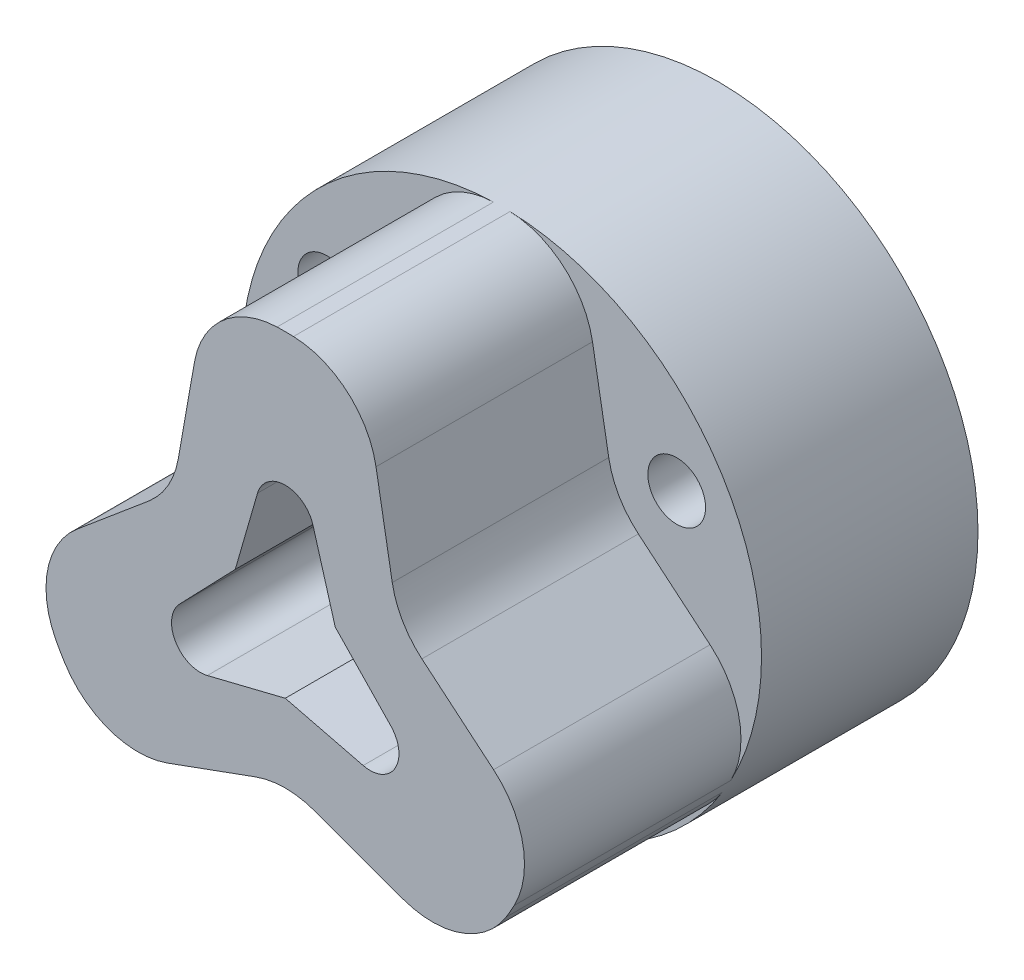
ISO-10303-21;
HEADER;
FILE_DESCRIPTION(('STEP AP214'),'2;1');
FILE_NAME('part.step','',(''),(''),'','','');
FILE_SCHEMA(('AUTOMOTIVE_DESIGN { 1 0 10303 214 1 1 1 1 }'));
ENDSEC;
DATA;
#1=APPLICATION_CONTEXT('core data for automotive mechanical design processes');
#2=APPLICATION_PROTOCOL_DEFINITION('international standard','automotive_design',2000,#1);
#3=PRODUCT_CONTEXT('',#1,'mechanical');
#4=PRODUCT('Part','Part','',(#3));
#5=PRODUCT_RELATED_PRODUCT_CATEGORY('part','',(#4));
#6=PRODUCT_DEFINITION_FORMATION('','',#4);
#7=PRODUCT_DEFINITION_CONTEXT('part definition',#1,'design');
#8=PRODUCT_DEFINITION('design','',#6,#7);
#9=PRODUCT_DEFINITION_SHAPE('','',#8);
#10=(LENGTH_UNIT() NAMED_UNIT(*) SI_UNIT(.MILLI.,.METRE.));
#11=(NAMED_UNIT(*) PLANE_ANGLE_UNIT() SI_UNIT($,.RADIAN.));
#12=(NAMED_UNIT(*) SI_UNIT($,.STERADIAN.) SOLID_ANGLE_UNIT());
#13=UNCERTAINTY_MEASURE_WITH_UNIT(LENGTH_MEASURE(1.E-05),#10,'distance_accuracy_value','');
#14=(GEOMETRIC_REPRESENTATION_CONTEXT(3) GLOBAL_UNCERTAINTY_ASSIGNED_CONTEXT((#13)) GLOBAL_UNIT_ASSIGNED_CONTEXT((#10,
#11,#12)) REPRESENTATION_CONTEXT('',''));
#15=CARTESIAN_POINT('',(0.,0.,0.));
#16=DIRECTION('',(0.,0.,1.));
#17=DIRECTION('',(1.,0.,0.));
#18=AXIS2_PLACEMENT_3D('',#15,#16,#17);
#19=CARTESIAN_POINT('',(0.,-14.,40.));
#20=DIRECTION('',(0.,0.,-1.));
#21=DIRECTION('',(-1.,0.,0.));
#22=AXIS2_PLACEMENT_3D('',#19,#20,#21);
#23=CYLINDRICAL_SURFACE('',#22,2.);
#24=CARTESIAN_POINT('',(0.,-14.,0.));
#25=DIRECTION('',(0.,0.,-1.));
#26=DIRECTION('',(0.499999999999992,-0.866025403784443,0.));
#27=AXIS2_PLACEMENT_3D('',#24,#25,#26);
#28=CIRCLE('',#27,2.);
#29=CARTESIAN_POINT('',(0.999999999999885,-15.7320508075689,0.));
#30=VERTEX_POINT('',#29);
#31=EDGE_CURVE('E293',#30,#30,#28,.T.);
#32=ORIENTED_EDGE('',*,*,#31,.T.);
#33=EDGE_LOOP('',(#32));
#34=FACE_BOUND('',#33,.T.);
#35=CARTESIAN_POINT('',(0.,-14.,15.));
#36=DIRECTION('',(0.,0.,1.));
#37=DIRECTION('',(1.,0.,0.));
#38=AXIS2_PLACEMENT_3D('',#35,#36,#37);
#39=CIRCLE('',#38,2.);
#40=CARTESIAN_POINT('',(1.9999999999999,-14.,15.));
#41=VERTEX_POINT('',#40);
#42=EDGE_CURVE('E290',#41,#41,#39,.F.);
#43=ORIENTED_EDGE('',*,*,#42,.F.);
#44=EDGE_LOOP('',(#43));
#45=FACE_BOUND('',#44,.T.);
#46=ADVANCED_FACE('F32',(#34,#45),#23,.F.);
#47=CARTESIAN_POINT('',(12.1243556529822,6.99999999999997,40.));
#48=DIRECTION('',(0.,0.,-1.));
#49=DIRECTION('',(-1.,0.,0.));
#50=AXIS2_PLACEMENT_3D('',#47,#48,#49);
#51=CYLINDRICAL_SURFACE('',#50,2.);
#52=CARTESIAN_POINT('',(12.1243556529822,6.99999999999997,0.));
#53=DIRECTION('',(0.,0.,-1.));
#54=DIRECTION('',(0.500000000000004,0.866025403784436,0.));
#55=AXIS2_PLACEMENT_3D('',#52,#53,#54);
#56=CIRCLE('',#55,2.);
#57=CARTESIAN_POINT('',(13.1243556529822,8.73205080756884,0.));
#58=VERTEX_POINT('',#57);
#59=EDGE_CURVE('E294',#58,#58,#56,.T.);
#60=ORIENTED_EDGE('',*,*,#59,.T.);
#61=EDGE_LOOP('',(#60));
#62=FACE_BOUND('',#61,.T.);
#63=CARTESIAN_POINT('',(12.1243556529822,6.99999999999997,15.));
#64=DIRECTION('',(0.,0.,1.));
#65=DIRECTION('',(1.,0.,0.));
#66=AXIS2_PLACEMENT_3D('',#63,#64,#65);
#67=CIRCLE('',#66,2.);
#68=CARTESIAN_POINT('',(14.1243556529822,6.99999999999997,15.));
#69=VERTEX_POINT('',#68);
#70=EDGE_CURVE('E271',#69,#69,#67,.F.);
#71=ORIENTED_EDGE('',*,*,#70,.F.);
#72=EDGE_LOOP('',(#71));
#73=FACE_BOUND('',#72,.T.);
#74=ADVANCED_FACE('F463',(#62,#73),#51,.F.);
#75=CARTESIAN_POINT('',(-12.1243556529822,6.99999999999997,40.));
#76=DIRECTION('',(0.,0.,-1.));
#77=DIRECTION('',(-1.,0.,0.));
#78=AXIS2_PLACEMENT_3D('',#75,#76,#77);
#79=CYLINDRICAL_SURFACE('',#78,2.);
#80=CARTESIAN_POINT('',(-12.1243556529822,6.99999999999997,0.));
#81=DIRECTION('',(0.,0.,-1.));
#82=DIRECTION('',(-1.,0.,0.));
#83=AXIS2_PLACEMENT_3D('',#80,#81,#82);
#84=CIRCLE('',#83,2.);
#85=CARTESIAN_POINT('',(-14.1243556529822,6.99999999999997,0.));
#86=VERTEX_POINT('',#85);
#87=EDGE_CURVE('E314',#86,#86,#84,.T.);
#88=ORIENTED_EDGE('',*,*,#87,.T.);
#89=EDGE_LOOP('',(#88));
#90=FACE_BOUND('',#89,.T.);
#91=CARTESIAN_POINT('',(-12.1243556529822,6.99999999999997,15.));
#92=DIRECTION('',(0.,0.,1.));
#93=DIRECTION('',(1.,0.,0.));
#94=AXIS2_PLACEMENT_3D('',#91,#92,#93);
#95=CIRCLE('',#94,2.);
#96=CARTESIAN_POINT('',(-10.1243556529822,6.99999999999997,15.));
#97=VERTEX_POINT('',#96);
#98=EDGE_CURVE('E307',#97,#97,#95,.F.);
#99=ORIENTED_EDGE('',*,*,#98,.F.);
#100=EDGE_LOOP('',(#99));
#101=FACE_BOUND('',#100,.T.);
#102=ADVANCED_FACE('F469',(#90,#101),#79,.F.);
#103=CARTESIAN_POINT('',(0.,0.,30.));
#104=DIRECTION('',(0.,0.,-1.));
#105=DIRECTION('',(-1.,0.,0.));
#106=AXIS2_PLACEMENT_3D('',#103,#104,#105);
#107=CYLINDRICAL_SURFACE('',#106,18.);
#108=CARTESIAN_POINT('',(0.,0.,30.));
#109=DIRECTION('',(0.,0.,1.));
#110=DIRECTION('',(1.,0.,0.));
#111=AXIS2_PLACEMENT_3D('',#108,#109,#110);
#112=CIRCLE('',#111,18.);
#113=CARTESIAN_POINT('',(15.2954184262269,-9.48947707551049,30.));
#114=VERTEX_POINT('',#113);
#115=CARTESIAN_POINT('',(15.8658374291354,-8.5014823808702,30.));
#116=VERTEX_POINT('',#115);
#117=EDGE_CURVE('E322',#114,#116,#112,.T.);
#118=ORIENTED_EDGE('',*,*,#117,.F.);
#119=DIRECTION('',(0.,0.,-1.));
#120=VECTOR('',#119,1.);
#121=CARTESIAN_POINT('',(15.2954184262269,-9.4894770755105,30.));
#122=LINE('',#121,#120);
#123=CARTESIAN_POINT('',(15.2954184262269,-9.48947707551049,15.));
#124=VERTEX_POINT('',#123);
#125=EDGE_CURVE('E408',#114,#124,#122,.T.);
#126=ORIENTED_EDGE('',*,*,#125,.T.);
#127=CARTESIAN_POINT('',(0.,0.,15.));
#128=DIRECTION('',(0.,0.,1.));
#129=DIRECTION('',(1.,0.,0.));
#130=AXIS2_PLACEMENT_3D('',#127,#128,#129);
#131=CIRCLE('',#130,18.);
#132=CARTESIAN_POINT('',(-15.2954184262271,-9.48947707551007,15.));
#133=VERTEX_POINT('',#132);
#134=EDGE_CURVE('E291',#133,#124,#131,.T.);
#135=ORIENTED_EDGE('',*,*,#134,.F.);
#136=DIRECTION('',(0.,0.,-1.));
#137=VECTOR('',#136,1.);
#138=CARTESIAN_POINT('',(-15.2954184262271,-9.48947707551007,30.));
#139=LINE('',#138,#137);
#140=CARTESIAN_POINT('',(-15.2954184262271,-9.48947707551007,30.));
#141=VERTEX_POINT('',#140);
#142=EDGE_CURVE('E405',#133,#141,#139,.F.);
#143=ORIENTED_EDGE('',*,*,#142,.T.);
#144=CARTESIAN_POINT('',(-15.8658374291355,-8.50148238086998,30.));
#145=VERTEX_POINT('',#144);
#146=EDGE_CURVE('E318',#145,#141,#112,.T.);
#147=ORIENTED_EDGE('',*,*,#146,.F.);
#148=DIRECTION('',(0.,0.,-1.));
#149=VECTOR('',#148,1.);
#150=CARTESIAN_POINT('',(-15.8658374291355,-8.50148238086998,30.));
#151=LINE('',#150,#149);
#152=CARTESIAN_POINT('',(-15.8658374291355,-8.50148238086998,15.));
#153=VERTEX_POINT('',#152);
#154=EDGE_CURVE('E346',#145,#153,#151,.T.);
#155=ORIENTED_EDGE('',*,*,#154,.T.);
#156=CARTESIAN_POINT('',(0.,0.,15.));
#157=DIRECTION('',(0.,0.,1.));
#158=DIRECTION('',(1.,0.,0.));
#159=AXIS2_PLACEMENT_3D('',#156,#157,#158);
#160=CIRCLE('',#159,18.);
#161=CARTESIAN_POINT('',(-0.570419002908376,17.9909594563803,15.));
#162=VERTEX_POINT('',#161);
#163=EDGE_CURVE('E312',#162,#153,#160,.T.);
#164=ORIENTED_EDGE('',*,*,#163,.F.);
#165=DIRECTION('',(0.,0.,-1.));
#166=VECTOR('',#165,1.);
#167=CARTESIAN_POINT('',(-0.570419002908376,17.9909594563803,30.));
#168=LINE('',#167,#166);
#169=CARTESIAN_POINT('',(-0.570419002908376,17.9909594563803,30.));
#170=VERTEX_POINT('',#169);
#171=EDGE_CURVE('E343',#162,#170,#168,.F.);
#172=ORIENTED_EDGE('',*,*,#171,.T.);
#173=CARTESIAN_POINT('',(0.570419002908632,17.9909594563803,30.));
#174=VERTEX_POINT('',#173);
#175=EDGE_CURVE('E323',#174,#170,#112,.T.);
#176=ORIENTED_EDGE('',*,*,#175,.F.);
#177=DIRECTION('',(0.,0.,-1.));
#178=VECTOR('',#177,1.);
#179=CARTESIAN_POINT('',(0.570419002908632,17.9909594563803,30.));
#180=LINE('',#179,#178);
#181=CARTESIAN_POINT('',(0.570419002908632,17.9909594563803,15.));
#182=VERTEX_POINT('',#181);
#183=EDGE_CURVE('E379',#174,#182,#180,.T.);
#184=ORIENTED_EDGE('',*,*,#183,.T.);
#185=CARTESIAN_POINT('',(0.,0.,15.));
#186=DIRECTION('',(0.,0.,1.));
#187=DIRECTION('',(1.,0.,0.));
#188=AXIS2_PLACEMENT_3D('',#185,#186,#187);
#189=CIRCLE('',#188,18.);
#190=CARTESIAN_POINT('',(15.8658374291354,-8.5014823808702,15.));
#191=VERTEX_POINT('',#190);
#192=EDGE_CURVE('E288',#191,#182,#189,.T.);
#193=ORIENTED_EDGE('',*,*,#192,.F.);
#194=DIRECTION('',(0.,0.,-1.));
#195=VECTOR('',#194,1.);
#196=CARTESIAN_POINT('',(15.8658374291354,-8.5014823808702,30.));
#197=LINE('',#196,#195);
#198=EDGE_CURVE('E376',#191,#116,#197,.F.);
#199=ORIENTED_EDGE('',*,*,#198,.T.);
#200=EDGE_LOOP('',(#118,#126,#135,#143,#147,#155,#164,#172,#176,#184,#193,#199));
#201=FACE_BOUND('',#200,.T.);
#202=CARTESIAN_POINT('',(0.,0.,0.));
#203=DIRECTION('',(0.,0.,1.));
#204=DIRECTION('',(1.,0.,0.));
#205=AXIS2_PLACEMENT_3D('',#202,#203,#204);
#206=CIRCLE('',#205,18.);
#207=CARTESIAN_POINT('',(18.,0.,0.));
#208=VERTEX_POINT('',#207);
#209=EDGE_CURVE('E317',#208,#208,#206,.T.);
#210=ORIENTED_EDGE('',*,*,#209,.T.);
#211=EDGE_LOOP('',(#210));
#212=FACE_BOUND('',#211,.T.);
#213=ADVANCED_FACE('F490',(#201,#212),#107,.T.);
#214=CARTESIAN_POINT('',(0.,0.,30.));
#215=DIRECTION('',(0.,0.,1.));
#216=DIRECTION('',(1.,0.,0.));
#217=AXIS2_PLACEMENT_3D('',#214,#215,#216);
#218=PLANE('',#217);
#219=DIRECTION('',(0.97072534339415,-0.240192230707636,0.));
#220=VECTOR('',#219,1.);
#221=CARTESIAN_POINT('',(-0.932642742537106,-3.76923076923076,30.));
#222=LINE('',#221,#220);
#223=CARTESIAN_POINT('',(0.,-4.,30.));
#224=VERTEX_POINT('',#223);
#225=CARTESIAN_POINT('',(5.39897319316845,-5.33589941132433,30.));
#226=VERTEX_POINT('',#225);
#227=EDGE_CURVE('E247',#224,#226,#222,.T.);
#228=ORIENTED_EDGE('',*,*,#227,.F.);
#229=DIRECTION('',(0.97072534339415,0.240192230707636,0.));
#230=VECTOR('',#229,1.);
#231=CARTESIAN_POINT('',(0.932642742537106,-3.76923076923076,30.));
#232=LINE('',#231,#230);
#233=CARTESIAN_POINT('',(-5.39897319316845,-5.33589941132434,30.));
#234=VERTEX_POINT('',#233);
#235=EDGE_CURVE('E256',#234,#224,#232,.T.);
#236=ORIENTED_EDGE('',*,*,#235,.F.);
#237=CARTESIAN_POINT('',(-5.87935765458372,-3.39444872453604,30.));
#238=DIRECTION('',(0.,0.,1.));
#239=DIRECTION('',(1.,0.,0.));
#240=AXIS2_PLACEMENT_3D('',#237,#238,#239);
#241=CIRCLE('',#240,2.);
#242=CARTESIAN_POINT('',(-7.32051103882951,-2.00769823397297,30.));
#243=VERTEX_POINT('',#242);
#244=EDGE_CURVE('E433',#234,#243,#241,.F.);
#245=ORIENTED_EDGE('',*,*,#244,.T.);
#246=DIRECTION('',(0.693375245281533,0.720576692122896,0.));
#247=VECTOR('',#246,1.);
#248=CARTESIAN_POINT('',(-2.79792822761128,2.69230769230768,30.));
#249=LINE('',#248,#247);
#250=CARTESIAN_POINT('',(-3.46410161513776,1.99999999999999,30.));
#251=VERTEX_POINT('',#250);
#252=EDGE_CURVE('E254',#243,#251,#249,.T.);
#253=ORIENTED_EDGE('',*,*,#252,.T.);
#254=DIRECTION('',(0.277350098112615,0.960768922830523,0.));
#255=VECTOR('',#254,1.);
#256=CARTESIAN_POINT('',(-3.73057097014835,1.07692307692308,30.));
#257=LINE('',#256,#255);
#258=CARTESIAN_POINT('',(-1.92153784566105,7.34359764529726,30.));
#259=VERTEX_POINT('',#258);
#260=EDGE_CURVE('E231',#251,#259,#257,.T.);
#261=ORIENTED_EDGE('',*,*,#260,.T.);
#262=CARTESIAN_POINT('',(0.,6.78889744907203,30.));
#263=DIRECTION('',(0.,0.,1.));
#264=DIRECTION('',(1.,0.,0.));
#265=AXIS2_PLACEMENT_3D('',#262,#263,#264);
#266=CIRCLE('',#265,2.);
#267=CARTESIAN_POINT('',(1.92153784566105,7.34359764529726,30.));
#268=VERTEX_POINT('',#267);
#269=EDGE_CURVE('E430',#259,#268,#266,.F.);
#270=ORIENTED_EDGE('',*,*,#269,.T.);
#271=DIRECTION('',(0.277350098112615,-0.960768922830523,0.));
#272=VECTOR('',#271,1.);
#273=CARTESIAN_POINT('',(3.73057097014835,1.07692307692308,30.));
#274=LINE('',#273,#272);
#275=CARTESIAN_POINT('',(3.46410161513776,1.99999999999999,30.));
#276=VERTEX_POINT('',#275);
#277=EDGE_CURVE('E251',#268,#276,#274,.T.);
#278=ORIENTED_EDGE('',*,*,#277,.T.);
#279=DIRECTION('',(0.693375245281533,-0.720576692122896,0.));
#280=VECTOR('',#279,1.);
#281=CARTESIAN_POINT('',(2.79792822761128,2.69230769230768,30.));
#282=LINE('',#281,#280);
#283=CARTESIAN_POINT('',(7.32051103882951,-2.00769823397297,30.));
#284=VERTEX_POINT('',#283);
#285=EDGE_CURVE('E249',#276,#284,#282,.T.);
#286=ORIENTED_EDGE('',*,*,#285,.T.);
#287=CARTESIAN_POINT('',(5.87935765458372,-3.39444872453603,30.));
#288=DIRECTION('',(0.,0.,1.));
#289=DIRECTION('',(1.,0.,0.));
#290=AXIS2_PLACEMENT_3D('',#287,#288,#289);
#291=CIRCLE('',#290,2.);
#292=EDGE_CURVE('E40',#284,#226,#291,.F.);
#293=ORIENTED_EDGE('',*,*,#292,.T.);
#294=EDGE_LOOP('',(#228,#236,#245,#253,#261,#270,#278,#286,#293));
#295=FACE_BOUND('',#294,.T.);
#296=DIRECTION('',(-0.939692620785902,0.342020143325686,0.));
#297=VECTOR('',#296,1.);
#298=CARTESIAN_POINT('',(-1.25767452008319E-13,-9.,30.));
#299=LINE('',#298,#297);
#300=CARTESIAN_POINT('',(8.14482475753047,-11.9644737750557,30.));
#301=VERTEX_POINT('',#300);
#302=CARTESIAN_POINT('',(2.0521208599539,-9.74691091014007,30.));
#303=VERTEX_POINT('',#302);
#304=EDGE_CURVE('E260',#301,#303,#299,.T.);
#305=ORIENTED_EDGE('',*,*,#304,.F.);
#306=CARTESIAN_POINT('',(10.1969456174846,-6.32631805034033,30.));
#307=DIRECTION('',(0.,0.,1.));
#308=DIRECTION('',(1.,0.,0.));
#309=AXIS2_PLACEMENT_3D('',#306,#307,#308);
#310=CIRCLE('',#309,6.);
#311=EDGE_CURVE('E403',#301,#114,#310,.T.);
#312=ORIENTED_EDGE('',*,*,#311,.T.);
#313=ORIENTED_EDGE('',*,*,#117,.T.);
#314=CARTESIAN_POINT('',(10.5772249527569,-5.66765492058013,30.));
#315=DIRECTION('',(0.,0.,1.));
#316=DIRECTION('',(1.,0.,0.));
#317=AXIS2_PLACEMENT_3D('',#314,#315,#316);
#318=CIRCLE('',#317,6.);
#319=CARTESIAN_POINT('',(14.4339506108762,-1.07138826186629,30.));
#320=VERTEX_POINT('',#319);
#321=EDGE_CURVE('E372',#116,#320,#318,.T.);
#322=ORIENTED_EDGE('',*,*,#321,.T.);
#323=DIRECTION('',(0.766044443118975,-0.642787609686543,0.));
#324=VECTOR('',#323,1.);
#325=CARTESIAN_POINT('',(7.79422863405999,4.49999999999993,30.));
#326=LINE('',#325,#324);
#327=CARTESIAN_POINT('',(9.46713288658203,3.09626665871377,30.));
#328=VERTEX_POINT('',#327);
#329=EDGE_CURVE('E268',#328,#320,#326,.T.);
#330=ORIENTED_EDGE('',*,*,#329,.F.);
#331=CARTESIAN_POINT('',(13.3238585447013,7.69253331742762,30.));
#332=DIRECTION('',(0.,0.,1.));
#333=DIRECTION('',(1.,0.,0.));
#334=AXIS2_PLACEMENT_3D('',#331,#332,#333);
#335=CIRCLE('',#334,6.);
#336=CARTESIAN_POINT('',(7.41501202662803,6.65064425142612,30.));
#337=VERTEX_POINT('',#336);
#338=EDGE_CURVE('E382',#328,#337,#335,.F.);
#339=ORIENTED_EDGE('',*,*,#338,.T.);
#340=DIRECTION('',(0.173648177666917,-0.984807753012211,0.));
#341=VECTOR('',#340,1.);
#342=CARTESIAN_POINT('',(7.79422863405999,4.49999999999993,30.));
#343=LINE('',#342,#341);
#344=CARTESIAN_POINT('',(6.28912585334568,13.0358620369217,30.));
#345=VERTEX_POINT('',#344);
#346=EDGE_CURVE('E272',#345,#337,#343,.T.);
#347=ORIENTED_EDGE('',*,*,#346,.F.);
#348=CARTESIAN_POINT('',(0.380279335272421,11.9939729709202,30.));
#349=DIRECTION('',(0.,0.,1.));
#350=DIRECTION('',(1.,0.,0.));
#351=AXIS2_PLACEMENT_3D('',#348,#349,#350);
#352=CIRCLE('',#351,6.);
#353=EDGE_CURVE('E374',#345,#174,#352,.T.);
#354=ORIENTED_EDGE('',*,*,#353,.T.);
#355=ORIENTED_EDGE('',*,*,#175,.T.);
#356=CARTESIAN_POINT('',(-0.38027933527225,11.9939729709202,30.));
#357=DIRECTION('',(0.,0.,1.));
#358=DIRECTION('',(1.,0.,0.));
#359=AXIS2_PLACEMENT_3D('',#356,#357,#358);
#360=CIRCLE('',#359,6.);
#361=CARTESIAN_POINT('',(-6.2891258533455,13.0358620369218,30.));
#362=VERTEX_POINT('',#361);
#363=EDGE_CURVE('E339',#170,#362,#360,.T.);
#364=ORIENTED_EDGE('',*,*,#363,.T.);
#365=DIRECTION('',(0.173648177666931,0.984807753012208,0.));
#366=VECTOR('',#365,1.);
#367=CARTESIAN_POINT('',(-7.79422863405993,4.50000000000004,30.));
#368=LINE('',#367,#366);
#369=CARTESIAN_POINT('',(-7.41501202662793,6.65064425142622,30.));
#370=VERTEX_POINT('',#369);
#371=EDGE_CURVE('E304',#370,#362,#368,.T.);
#372=ORIENTED_EDGE('',*,*,#371,.F.);
#373=CARTESIAN_POINT('',(-13.3238585447012,7.6925333174278,30.));
#374=DIRECTION('',(0.,0.,1.));
#375=DIRECTION('',(1.,0.,0.));
#376=AXIS2_PLACEMENT_3D('',#373,#374,#375);
#377=CIRCLE('',#376,6.);
#378=CARTESIAN_POINT('',(-9.46713288658198,3.0962666587139,30.));
#379=VERTEX_POINT('',#378);
#380=EDGE_CURVE('E349',#370,#379,#377,.F.);
#381=ORIENTED_EDGE('',*,*,#380,.T.);
#382=DIRECTION('',(0.766044443118984,0.642787609686533,0.));
#383=VECTOR('',#382,1.);
#384=CARTESIAN_POINT('',(-7.79422863405993,4.50000000000004,30.));
#385=LINE('',#384,#383);
#386=CARTESIAN_POINT('',(-14.4339506108762,-1.07138826186608,30.));
#387=VERTEX_POINT('',#386);
#388=EDGE_CURVE('E297',#387,#379,#385,.T.);
#389=ORIENTED_EDGE('',*,*,#388,.F.);
#390=CARTESIAN_POINT('',(-10.577224952757,-5.66765492057999,30.));
#391=DIRECTION('',(0.,0.,1.));
#392=DIRECTION('',(1.,0.,0.));
#393=AXIS2_PLACEMENT_3D('',#390,#391,#392);
#394=CIRCLE('',#393,6.);
#395=EDGE_CURVE('E341',#387,#145,#394,.T.);
#396=ORIENTED_EDGE('',*,*,#395,.T.);
#397=ORIENTED_EDGE('',*,*,#146,.T.);
#398=CARTESIAN_POINT('',(-10.1969456174848,-6.32631805034005,30.));
#399=DIRECTION('',(0.,0.,1.));
#400=DIRECTION('',(1.,0.,0.));
#401=AXIS2_PLACEMENT_3D('',#398,#399,#400);
#402=CIRCLE('',#401,6.);
#403=CARTESIAN_POINT('',(-8.14482475753081,-11.9644737750555,30.));
#404=VERTEX_POINT('',#403);
#405=EDGE_CURVE('E401',#141,#404,#402,.T.);
#406=ORIENTED_EDGE('',*,*,#405,.T.);
#407=DIRECTION('',(-0.939692620785912,-0.342020143325659,0.));
#408=VECTOR('',#407,1.);
#409=CARTESIAN_POINT('',(-1.25767452008319E-13,-9.,30.));
#410=LINE('',#409,#408);
#411=CARTESIAN_POINT('',(-2.05212085995417,-9.74691091014001,30.));
#412=VERTEX_POINT('',#411);
#413=EDGE_CURVE('E281',#412,#404,#410,.T.);
#414=ORIENTED_EDGE('',*,*,#413,.F.);
#415=CARTESIAN_POINT('',(-2.15105711021124E-13,-15.3850666348555,30.));
#416=DIRECTION('',(0.,0.,1.));
#417=DIRECTION('',(1.,0.,0.));
#418=AXIS2_PLACEMENT_3D('',#415,#416,#417);
#419=CIRCLE('',#418,6.);
#420=EDGE_CURVE('E411',#412,#303,#419,.F.);
#421=ORIENTED_EDGE('',*,*,#420,.T.);
#422=EDGE_LOOP('',(#305,#312,#313,#322,#330,#339,#347,#354,#355,#364,#372,#381,#389,#396,#397,
#406,#414,#421));
#423=FACE_BOUND('',#422,.T.);
#424=ADVANCED_FACE('F444',(#295,#423),#218,.T.);
#425=CARTESIAN_POINT('',(0.,0.,0.));
#426=DIRECTION('',(0.,0.,1.));
#427=DIRECTION('',(1.,0.,0.));
#428=AXIS2_PLACEMENT_3D('',#425,#426,#427);
#429=PLANE('',#428);
#430=DIRECTION('',(0.693375245281533,0.720576692122896,0.));
#431=VECTOR('',#430,1.);
#432=CARTESIAN_POINT('',(-2.79792822761128,2.69230769230768,0.));
#433=LINE('',#432,#431);
#434=CARTESIAN_POINT('',(-7.32051103882951,-2.00769823397297,0.));
#435=VERTEX_POINT('',#434);
#436=CARTESIAN_POINT('',(-3.46410161513776,1.99999999999999,0.));
#437=VERTEX_POINT('',#436);
#438=EDGE_CURVE('E211',#435,#437,#433,.T.);
#439=ORIENTED_EDGE('',*,*,#438,.F.);
#440=CARTESIAN_POINT('',(-5.87935765458372,-3.39444872453604,0.));
#441=DIRECTION('',(0.,0.,1.));
#442=DIRECTION('',(1.,0.,0.));
#443=AXIS2_PLACEMENT_3D('',#440,#441,#442);
#444=CIRCLE('',#443,2.);
#445=CARTESIAN_POINT('',(-5.39897319316845,-5.33589941132434,0.));
#446=VERTEX_POINT('',#445);
#447=EDGE_CURVE('E435',#435,#446,#444,.T.);
#448=ORIENTED_EDGE('',*,*,#447,.T.);
#449=DIRECTION('',(0.97072534339415,0.240192230707636,0.));
#450=VECTOR('',#449,1.);
#451=CARTESIAN_POINT('',(0.932642742537106,-3.76923076923076,0.));
#452=LINE('',#451,#450);
#453=CARTESIAN_POINT('',(0.,-4.,0.));
#454=VERTEX_POINT('',#453);
#455=EDGE_CURVE('E222',#446,#454,#452,.T.);
#456=ORIENTED_EDGE('',*,*,#455,.T.);
#457=DIRECTION('',(0.97072534339415,-0.240192230707636,0.));
#458=VECTOR('',#457,1.);
#459=CARTESIAN_POINT('',(-0.932642742537106,-3.76923076923076,0.));
#460=LINE('',#459,#458);
#461=CARTESIAN_POINT('',(5.39897319316845,-5.33589941132433,0.));
#462=VERTEX_POINT('',#461);
#463=EDGE_CURVE('E258',#454,#462,#460,.T.);
#464=ORIENTED_EDGE('',*,*,#463,.T.);
#465=CARTESIAN_POINT('',(5.87935765458372,-3.39444872453603,0.));
#466=DIRECTION('',(0.,0.,1.));
#467=DIRECTION('',(1.,0.,0.));
#468=AXIS2_PLACEMENT_3D('',#465,#466,#467);
#469=CIRCLE('',#468,2.);
#470=CARTESIAN_POINT('',(7.32051103882951,-2.00769823397297,0.));
#471=VERTEX_POINT('',#470);
#472=EDGE_CURVE('E11',#462,#471,#469,.T.);
#473=ORIENTED_EDGE('',*,*,#472,.T.);
#474=DIRECTION('',(0.693375245281533,-0.720576692122896,0.));
#475=VECTOR('',#474,1.);
#476=CARTESIAN_POINT('',(2.79792822761128,2.69230769230768,0.));
#477=LINE('',#476,#475);
#478=CARTESIAN_POINT('',(3.46410161513776,1.99999999999999,0.));
#479=VERTEX_POINT('',#478);
#480=EDGE_CURVE('E242',#479,#471,#477,.T.);
#481=ORIENTED_EDGE('',*,*,#480,.F.);
#482=DIRECTION('',(0.277350098112615,-0.960768922830523,0.));
#483=VECTOR('',#482,1.);
#484=CARTESIAN_POINT('',(3.73057097014835,1.07692307692308,0.));
#485=LINE('',#484,#483);
#486=CARTESIAN_POINT('',(1.92153784566105,7.34359764529726,0.));
#487=VERTEX_POINT('',#486);
#488=EDGE_CURVE('E240',#487,#479,#485,.T.);
#489=ORIENTED_EDGE('',*,*,#488,.F.);
#490=CARTESIAN_POINT('',(0.,6.78889744907203,0.));
#491=DIRECTION('',(0.,0.,1.));
#492=DIRECTION('',(1.,0.,0.));
#493=AXIS2_PLACEMENT_3D('',#490,#491,#492);
#494=CIRCLE('',#493,2.);
#495=CARTESIAN_POINT('',(-1.92153784566105,7.34359764529726,0.));
#496=VERTEX_POINT('',#495);
#497=EDGE_CURVE('E239',#487,#496,#494,.T.);
#498=ORIENTED_EDGE('',*,*,#497,.T.);
#499=DIRECTION('',(0.277350098112615,0.960768922830523,0.));
#500=VECTOR('',#499,1.);
#501=CARTESIAN_POINT('',(-3.73057097014835,1.07692307692308,0.));
#502=LINE('',#501,#500);
#503=EDGE_CURVE('E223',#437,#496,#502,.T.);
#504=ORIENTED_EDGE('',*,*,#503,.F.);
#505=EDGE_LOOP('',(#439,#448,#456,#464,#473,#481,#489,#498,#504));
#506=FACE_BOUND('',#505,.T.);
#507=ORIENTED_EDGE('',*,*,#59,.F.);
#508=EDGE_LOOP('',(#507));
#509=FACE_BOUND('',#508,.T.);
#510=ORIENTED_EDGE('',*,*,#31,.F.);
#511=EDGE_LOOP('',(#510));
#512=FACE_BOUND('',#511,.T.);
#513=ORIENTED_EDGE('',*,*,#87,.F.);
#514=EDGE_LOOP('',(#513));
#515=FACE_BOUND('',#514,.T.);
#516=ORIENTED_EDGE('',*,*,#209,.F.);
#517=EDGE_LOOP('',(#516));
#518=FACE_BOUND('',#517,.T.);
#519=ADVANCED_FACE('F235',(#506,#509,#512,#515,#518),#429,.F.);
#520=CARTESIAN_POINT('',(0.,0.,15.));
#521=DIRECTION('',(0.,0.,1.));
#522=DIRECTION('',(1.,0.,0.));
#523=AXIS2_PLACEMENT_3D('',#520,#521,#522);
#524=PLANE('',#523);
#525=ORIENTED_EDGE('',*,*,#98,.T.);
#526=EDGE_LOOP('',(#525));
#527=FACE_BOUND('',#526,.T.);
#528=DIRECTION('',(0.766044443118984,0.642787609686533,0.));
#529=VECTOR('',#528,1.);
#530=CARTESIAN_POINT('',(-7.79422863405993,4.50000000000004,15.));
#531=LINE('',#530,#529);
#532=CARTESIAN_POINT('',(-14.4339506108762,-1.07138826186608,15.));
#533=VERTEX_POINT('',#532);
#534=CARTESIAN_POINT('',(-9.46713288658198,3.0962666587139,15.));
#535=VERTEX_POINT('',#534);
#536=EDGE_CURVE('E300',#533,#535,#531,.T.);
#537=ORIENTED_EDGE('',*,*,#536,.T.);
#538=CARTESIAN_POINT('',(-13.3238585447012,7.6925333174278,15.));
#539=DIRECTION('',(0.,0.,1.));
#540=DIRECTION('',(1.,0.,0.));
#541=AXIS2_PLACEMENT_3D('',#538,#539,#540);
#542=CIRCLE('',#541,6.);
#543=CARTESIAN_POINT('',(-7.41501202662793,6.65064425142622,15.));
#544=VERTEX_POINT('',#543);
#545=EDGE_CURVE('E337',#535,#544,#542,.T.);
#546=ORIENTED_EDGE('',*,*,#545,.T.);
#547=DIRECTION('',(0.173648177666931,0.984807753012208,0.));
#548=VECTOR('',#547,1.);
#549=CARTESIAN_POINT('',(-7.79422863405993,4.50000000000004,15.));
#550=LINE('',#549,#548);
#551=CARTESIAN_POINT('',(-6.2891258533455,13.0358620369218,15.));
#552=VERTEX_POINT('',#551);
#553=EDGE_CURVE('E303',#544,#552,#550,.T.);
#554=ORIENTED_EDGE('',*,*,#553,.T.);
#555=CARTESIAN_POINT('',(-0.38027933527225,11.9939729709202,15.));
#556=DIRECTION('',(0.,0.,1.));
#557=DIRECTION('',(1.,0.,0.));
#558=AXIS2_PLACEMENT_3D('',#555,#556,#557);
#559=CIRCLE('',#558,6.);
#560=EDGE_CURVE('E353',#552,#162,#559,.F.);
#561=ORIENTED_EDGE('',*,*,#560,.T.);
#562=ORIENTED_EDGE('',*,*,#163,.T.);
#563=CARTESIAN_POINT('',(-10.577224952757,-5.66765492057999,15.));
#564=DIRECTION('',(0.,0.,1.));
#565=DIRECTION('',(1.,0.,0.));
#566=AXIS2_PLACEMENT_3D('',#563,#564,#565);
#567=CIRCLE('',#566,6.);
#568=EDGE_CURVE('E351',#153,#533,#567,.F.);
#569=ORIENTED_EDGE('',*,*,#568,.T.);
#570=EDGE_LOOP('',(#537,#546,#554,#561,#562,#569));
#571=FACE_BOUND('',#570,.T.);
#572=ADVANCED_FACE('F475',(#527,#571),#524,.T.);
#573=CARTESIAN_POINT('',(-7.79422863405993,4.50000000000004,15.));
#574=DIRECTION('',(0.642787609686533,-0.766044443118984,0.));
#575=DIRECTION('',(0.766044443118984,0.642787609686533,0.));
#576=AXIS2_PLACEMENT_3D('',#573,#574,#575);
#577=PLANE('',#576);
#578=ORIENTED_EDGE('',*,*,#388,.T.);
#579=DIRECTION('',(0.,0.,1.));
#580=VECTOR('',#579,1.);
#581=CARTESIAN_POINT('',(-9.46713288658198,3.0962666587139,15.));
#582=LINE('',#581,#580);
#583=EDGE_CURVE('E335',#379,#535,#582,.F.);
#584=ORIENTED_EDGE('',*,*,#583,.T.);
#585=ORIENTED_EDGE('',*,*,#536,.F.);
#586=DIRECTION('',(0.,0.,-1.));
#587=VECTOR('',#586,1.);
#588=CARTESIAN_POINT('',(-14.4339506108762,-1.07138826186608,15.));
#589=LINE('',#588,#587);
#590=EDGE_CURVE('E332',#533,#387,#589,.F.);
#591=ORIENTED_EDGE('',*,*,#590,.T.);
#592=EDGE_LOOP('',(#578,#584,#585,#591));
#593=FACE_BOUND('',#592,.T.);
#594=ADVANCED_FACE('F478',(#593),#577,.F.);
#595=CARTESIAN_POINT('',(-7.79422863405993,4.50000000000004,15.));
#596=DIRECTION('',(0.984807753012208,-0.173648177666931,0.));
#597=DIRECTION('',(0.173648177666931,0.984807753012208,0.));
#598=AXIS2_PLACEMENT_3D('',#595,#596,#597);
#599=PLANE('',#598);
#600=ORIENTED_EDGE('',*,*,#553,.F.);
#601=DIRECTION('',(0.,0.,1.));
#602=VECTOR('',#601,1.);
#603=CARTESIAN_POINT('',(-7.41501202662793,6.65064425142622,30.));
#604=LINE('',#603,#602);
#605=EDGE_CURVE('E329',#544,#370,#604,.T.);
#606=ORIENTED_EDGE('',*,*,#605,.T.);
#607=ORIENTED_EDGE('',*,*,#371,.T.);
#608=DIRECTION('',(0.,0.,-1.));
#609=VECTOR('',#608,1.);
#610=CARTESIAN_POINT('',(-6.2891258533455,13.0358620369218,15.));
#611=LINE('',#610,#609);
#612=EDGE_CURVE('E321',#362,#552,#611,.T.);
#613=ORIENTED_EDGE('',*,*,#612,.T.);
#614=EDGE_LOOP('',(#600,#606,#607,#613));
#615=FACE_BOUND('',#614,.T.);
#616=ADVANCED_FACE('F480',(#615),#599,.F.);
#617=CARTESIAN_POINT('',(-13.3238585447012,7.6925333174278,15.));
#618=DIRECTION('',(0.,0.,-1.));
#619=DIRECTION('',(-1.,0.,0.));
#620=AXIS2_PLACEMENT_3D('',#617,#618,#619);
#621=CYLINDRICAL_SURFACE('',#620,6.);
#622=ORIENTED_EDGE('',*,*,#545,.F.);
#623=ORIENTED_EDGE('',*,*,#583,.F.);
#624=ORIENTED_EDGE('',*,*,#380,.F.);
#625=ORIENTED_EDGE('',*,*,#605,.F.);
#626=EDGE_LOOP('',(#622,#623,#624,#625));
#627=FACE_BOUND('',#626,.T.);
#628=ADVANCED_FACE('F483',(#627),#621,.F.);
#629=CARTESIAN_POINT('',(-10.577224952757,-5.66765492057999,30.));
#630=DIRECTION('',(0.,0.,-1.));
#631=DIRECTION('',(-1.,0.,0.));
#632=AXIS2_PLACEMENT_3D('',#629,#630,#631);
#633=CYLINDRICAL_SURFACE('',#632,6.);
#634=ORIENTED_EDGE('',*,*,#568,.F.);
#635=ORIENTED_EDGE('',*,*,#154,.F.);
#636=ORIENTED_EDGE('',*,*,#395,.F.);
#637=ORIENTED_EDGE('',*,*,#590,.F.);
#638=EDGE_LOOP('',(#634,#635,#636,#637));
#639=FACE_BOUND('',#638,.T.);
#640=ADVANCED_FACE('F501',(#639),#633,.T.);
#641=CARTESIAN_POINT('',(-0.38027933527225,11.9939729709202,30.));
#642=DIRECTION('',(0.,0.,-1.));
#643=DIRECTION('',(-1.,0.,0.));
#644=AXIS2_PLACEMENT_3D('',#641,#642,#643);
#645=CYLINDRICAL_SURFACE('',#644,6.);
#646=ORIENTED_EDGE('',*,*,#560,.F.);
#647=ORIENTED_EDGE('',*,*,#612,.F.);
#648=ORIENTED_EDGE('',*,*,#363,.F.);
#649=ORIENTED_EDGE('',*,*,#171,.F.);
#650=EDGE_LOOP('',(#646,#647,#648,#649));
#651=FACE_BOUND('',#650,.T.);
#652=ADVANCED_FACE('F505',(#651),#645,.T.);
#653=CARTESIAN_POINT('',(0.,0.,15.));
#654=DIRECTION('',(0.,0.,1.));
#655=DIRECTION('',(-0.500000000000004,-0.866025403784436,0.));
#656=AXIS2_PLACEMENT_3D('',#653,#654,#655);
#657=PLANE('',#656);
#658=ORIENTED_EDGE('',*,*,#70,.T.);
#659=EDGE_LOOP('',(#658));
#660=FACE_BOUND('',#659,.T.);
#661=DIRECTION('',(0.173648177666917,-0.984807753012211,0.));
#662=VECTOR('',#661,1.);
#663=CARTESIAN_POINT('',(7.79422863405999,4.49999999999993,15.));
#664=LINE('',#663,#662);
#665=CARTESIAN_POINT('',(6.28912585334568,13.0358620369217,15.));
#666=VERTEX_POINT('',#665);
#667=CARTESIAN_POINT('',(7.41501202662803,6.65064425142612,15.));
#668=VERTEX_POINT('',#667);
#669=EDGE_CURVE('E264',#666,#668,#664,.T.);
#670=ORIENTED_EDGE('',*,*,#669,.T.);
#671=CARTESIAN_POINT('',(13.3238585447013,7.69253331742762,15.));
#672=DIRECTION('',(0.,0.,1.));
#673=DIRECTION('',(1.,0.,0.));
#674=AXIS2_PLACEMENT_3D('',#671,#672,#673);
#675=CIRCLE('',#674,6.);
#676=CARTESIAN_POINT('',(9.46713288658203,3.09626665871377,15.));
#677=VERTEX_POINT('',#676);
#678=EDGE_CURVE('E370',#668,#677,#675,.T.);
#679=ORIENTED_EDGE('',*,*,#678,.T.);
#680=DIRECTION('',(0.766044443118975,-0.642787609686543,0.));
#681=VECTOR('',#680,1.);
#682=CARTESIAN_POINT('',(7.79422863405999,4.49999999999993,15.));
#683=LINE('',#682,#681);
#684=CARTESIAN_POINT('',(14.4339506108762,-1.07138826186629,15.));
#685=VERTEX_POINT('',#684);
#686=EDGE_CURVE('E267',#677,#685,#683,.T.);
#687=ORIENTED_EDGE('',*,*,#686,.T.);
#688=CARTESIAN_POINT('',(10.5772249527569,-5.66765492058013,15.));
#689=DIRECTION('',(0.,0.,1.));
#690=DIRECTION('',(1.,0.,0.));
#691=AXIS2_PLACEMENT_3D('',#688,#689,#690);
#692=CIRCLE('',#691,6.);
#693=EDGE_CURVE('E386',#685,#191,#692,.F.);
#694=ORIENTED_EDGE('',*,*,#693,.T.);
#695=ORIENTED_EDGE('',*,*,#192,.T.);
#696=CARTESIAN_POINT('',(0.380279335272421,11.9939729709202,15.));
#697=DIRECTION('',(0.,0.,1.));
#698=DIRECTION('',(1.,0.,0.));
#699=AXIS2_PLACEMENT_3D('',#696,#697,#698);
#700=CIRCLE('',#699,6.);
#701=EDGE_CURVE('E384',#182,#666,#700,.F.);
#702=ORIENTED_EDGE('',*,*,#701,.T.);
#703=EDGE_LOOP('',(#670,#679,#687,#694,#695,#702));
#704=FACE_BOUND('',#703,.T.);
#705=ADVANCED_FACE('F509',(#660,#704),#657,.T.);
#706=CARTESIAN_POINT('',(7.79422863405999,4.49999999999993,15.));
#707=DIRECTION('',(-0.98480775301221,-0.173648177666917,0.));
#708=DIRECTION('',(0.173648177666917,-0.984807753012211,0.));
#709=AXIS2_PLACEMENT_3D('',#706,#707,#708);
#710=PLANE('',#709);
#711=ORIENTED_EDGE('',*,*,#346,.T.);
#712=DIRECTION('',(0.,0.,1.));
#713=VECTOR('',#712,1.);
#714=CARTESIAN_POINT('',(7.41501202662803,6.65064425142612,15.));
#715=LINE('',#714,#713);
#716=EDGE_CURVE('E368',#337,#668,#715,.F.);
#717=ORIENTED_EDGE('',*,*,#716,.T.);
#718=ORIENTED_EDGE('',*,*,#669,.F.);
#719=DIRECTION('',(0.,0.,-1.));
#720=VECTOR('',#719,1.);
#721=CARTESIAN_POINT('',(6.28912585334568,13.0358620369217,15.));
#722=LINE('',#721,#720);
#723=EDGE_CURVE('E365',#666,#345,#722,.F.);
#724=ORIENTED_EDGE('',*,*,#723,.T.);
#725=EDGE_LOOP('',(#711,#717,#718,#724));
#726=FACE_BOUND('',#725,.T.);
#727=ADVANCED_FACE('F558',(#726),#710,.F.);
#728=CARTESIAN_POINT('',(7.79422863405999,4.49999999999993,15.));
#729=DIRECTION('',(-0.642787609686543,-0.766044443118975,0.));
#730=DIRECTION('',(0.766044443118975,-0.642787609686543,0.));
#731=AXIS2_PLACEMENT_3D('',#728,#729,#730);
#732=PLANE('',#731);
#733=ORIENTED_EDGE('',*,*,#686,.F.);
#734=DIRECTION('',(0.,0.,1.));
#735=VECTOR('',#734,1.);
#736=CARTESIAN_POINT('',(9.46713288658203,3.09626665871377,30.));
#737=LINE('',#736,#735);
#738=EDGE_CURVE('E362',#677,#328,#737,.T.);
#739=ORIENTED_EDGE('',*,*,#738,.T.);
#740=ORIENTED_EDGE('',*,*,#329,.T.);
#741=DIRECTION('',(0.,0.,-1.));
#742=VECTOR('',#741,1.);
#743=CARTESIAN_POINT('',(14.4339506108762,-1.07138826186628,15.));
#744=LINE('',#743,#742);
#745=EDGE_CURVE('E356',#320,#685,#744,.T.);
#746=ORIENTED_EDGE('',*,*,#745,.T.);
#747=EDGE_LOOP('',(#733,#739,#740,#746));
#748=FACE_BOUND('',#747,.T.);
#749=ADVANCED_FACE('F560',(#748),#732,.F.);
#750=CARTESIAN_POINT('',(0.,0.,15.));
#751=DIRECTION('',(0.,0.,1.));
#752=DIRECTION('',(-0.499999999999992,0.866025403784443,0.));
#753=AXIS2_PLACEMENT_3D('',#750,#751,#752);
#754=PLANE('',#753);
#755=ORIENTED_EDGE('',*,*,#42,.T.);
#756=EDGE_LOOP('',(#755));
#757=FACE_BOUND('',#756,.T.);
#758=DIRECTION('',(-0.939692620785902,0.342020143325686,0.));
#759=VECTOR('',#758,1.);
#760=CARTESIAN_POINT('',(-1.25767452008319E-13,-9.,15.));
#761=LINE('',#760,#759);
#762=CARTESIAN_POINT('',(8.14482475753047,-11.9644737750557,15.));
#763=VERTEX_POINT('',#762);
#764=CARTESIAN_POINT('',(2.0521208599539,-9.74691091014007,15.));
#765=VERTEX_POINT('',#764);
#766=EDGE_CURVE('E278',#763,#765,#761,.T.);
#767=ORIENTED_EDGE('',*,*,#766,.T.);
#768=CARTESIAN_POINT('',(-2.15105711021124E-13,-15.3850666348555,15.));
#769=DIRECTION('',(0.,0.,1.));
#770=DIRECTION('',(1.,0.,0.));
#771=AXIS2_PLACEMENT_3D('',#768,#769,#770);
#772=CIRCLE('',#771,6.);
#773=CARTESIAN_POINT('',(-2.05212085995417,-9.74691091014001,15.));
#774=VERTEX_POINT('',#773);
#775=EDGE_CURVE('E399',#765,#774,#772,.T.);
#776=ORIENTED_EDGE('',*,*,#775,.T.);
#777=DIRECTION('',(-0.939692620785912,-0.342020143325659,0.));
#778=VECTOR('',#777,1.);
#779=CARTESIAN_POINT('',(-1.25767452008319E-13,-9.,15.));
#780=LINE('',#779,#778);
#781=CARTESIAN_POINT('',(-8.14482475753081,-11.9644737750555,15.));
#782=VERTEX_POINT('',#781);
#783=EDGE_CURVE('E275',#774,#782,#780,.T.);
#784=ORIENTED_EDGE('',*,*,#783,.T.);
#785=CARTESIAN_POINT('',(-10.1969456174848,-6.32631805034005,15.));
#786=DIRECTION('',(0.,0.,1.));
#787=DIRECTION('',(1.,0.,0.));
#788=AXIS2_PLACEMENT_3D('',#785,#786,#787);
#789=CIRCLE('',#788,6.);
#790=EDGE_CURVE('E415',#782,#133,#789,.F.);
#791=ORIENTED_EDGE('',*,*,#790,.T.);
#792=ORIENTED_EDGE('',*,*,#134,.T.);
#793=CARTESIAN_POINT('',(10.1969456174846,-6.32631805034033,15.));
#794=DIRECTION('',(0.,0.,1.));
#795=DIRECTION('',(1.,0.,0.));
#796=AXIS2_PLACEMENT_3D('',#793,#794,#795);
#797=CIRCLE('',#796,6.);
#798=EDGE_CURVE('E413',#124,#763,#797,.F.);
#799=ORIENTED_EDGE('',*,*,#798,.T.);
#800=EDGE_LOOP('',(#767,#776,#784,#791,#792,#799));
#801=FACE_BOUND('',#800,.T.);
#802=ADVANCED_FACE('F563',(#757,#801),#754,.T.);
#803=CARTESIAN_POINT('',(-1.25767452008319E-13,-9.,15.));
#804=DIRECTION('',(0.342020143325686,0.939692620785902,0.));
#805=DIRECTION('',(-0.939692620785902,0.342020143325686,0.));
#806=AXIS2_PLACEMENT_3D('',#803,#804,#805);
#807=PLANE('',#806);
#808=ORIENTED_EDGE('',*,*,#304,.T.);
#809=DIRECTION('',(0.,0.,1.));
#810=VECTOR('',#809,1.);
#811=CARTESIAN_POINT('',(2.0521208599539,-9.74691091014007,15.));
#812=LINE('',#811,#810);
#813=EDGE_CURVE('E397',#303,#765,#812,.F.);
#814=ORIENTED_EDGE('',*,*,#813,.T.);
#815=ORIENTED_EDGE('',*,*,#766,.F.);
#816=DIRECTION('',(0.,0.,-1.));
#817=VECTOR('',#816,1.);
#818=CARTESIAN_POINT('',(8.14482475753047,-11.9644737750557,15.));
#819=LINE('',#818,#817);
#820=EDGE_CURVE('E394',#763,#301,#819,.F.);
#821=ORIENTED_EDGE('',*,*,#820,.T.);
#822=EDGE_LOOP('',(#808,#814,#815,#821));
#823=FACE_BOUND('',#822,.T.);
#824=ADVANCED_FACE('F570',(#823),#807,.F.);
#825=CARTESIAN_POINT('',(-1.25767452008319E-13,-9.,15.));
#826=DIRECTION('',(-0.342020143325659,0.939692620785912,0.));
#827=DIRECTION('',(-0.939692620785912,-0.342020143325659,0.));
#828=AXIS2_PLACEMENT_3D('',#825,#826,#827);
#829=PLANE('',#828);
#830=ORIENTED_EDGE('',*,*,#783,.F.);
#831=DIRECTION('',(0.,0.,1.));
#832=VECTOR('',#831,1.);
#833=CARTESIAN_POINT('',(-2.05212085995417,-9.74691091014001,30.));
#834=LINE('',#833,#832);
#835=EDGE_CURVE('E391',#774,#412,#834,.T.);
#836=ORIENTED_EDGE('',*,*,#835,.T.);
#837=ORIENTED_EDGE('',*,*,#413,.T.);
#838=DIRECTION('',(0.,0.,-1.));
#839=VECTOR('',#838,1.);
#840=CARTESIAN_POINT('',(-8.14482475753081,-11.9644737750555,15.));
#841=LINE('',#840,#839);
#842=EDGE_CURVE('E389',#404,#782,#841,.T.);
#843=ORIENTED_EDGE('',*,*,#842,.T.);
#844=EDGE_LOOP('',(#830,#836,#837,#843));
#845=FACE_BOUND('',#844,.T.);
#846=ADVANCED_FACE('F515',(#845),#829,.F.);
#847=CARTESIAN_POINT('',(13.3238585447013,7.69253331742762,15.));
#848=DIRECTION('',(0.,0.,-1.));
#849=DIRECTION('',(-1.,0.,0.));
#850=AXIS2_PLACEMENT_3D('',#847,#848,#849);
#851=CYLINDRICAL_SURFACE('',#850,6.);
#852=ORIENTED_EDGE('',*,*,#678,.F.);
#853=ORIENTED_EDGE('',*,*,#716,.F.);
#854=ORIENTED_EDGE('',*,*,#338,.F.);
#855=ORIENTED_EDGE('',*,*,#738,.F.);
#856=EDGE_LOOP('',(#852,#853,#854,#855));
#857=FACE_BOUND('',#856,.T.);
#858=ADVANCED_FACE('F511',(#857),#851,.F.);
#859=CARTESIAN_POINT('',(0.380279335272421,11.9939729709202,30.));
#860=DIRECTION('',(0.,0.,-1.));
#861=DIRECTION('',(-1.,0.,0.));
#862=AXIS2_PLACEMENT_3D('',#859,#860,#861);
#863=CYLINDRICAL_SURFACE('',#862,6.);
#864=ORIENTED_EDGE('',*,*,#701,.F.);
#865=ORIENTED_EDGE('',*,*,#183,.F.);
#866=ORIENTED_EDGE('',*,*,#353,.F.);
#867=ORIENTED_EDGE('',*,*,#723,.F.);
#868=EDGE_LOOP('',(#864,#865,#866,#867));
#869=FACE_BOUND('',#868,.T.);
#870=ADVANCED_FACE('F514',(#869),#863,.T.);
#871=CARTESIAN_POINT('',(10.5772249527569,-5.66765492058013,30.));
#872=DIRECTION('',(0.,0.,-1.));
#873=DIRECTION('',(-1.,0.,0.));
#874=AXIS2_PLACEMENT_3D('',#871,#872,#873);
#875=CYLINDRICAL_SURFACE('',#874,6.);
#876=ORIENTED_EDGE('',*,*,#693,.F.);
#877=ORIENTED_EDGE('',*,*,#745,.F.);
#878=ORIENTED_EDGE('',*,*,#321,.F.);
#879=ORIENTED_EDGE('',*,*,#198,.F.);
#880=EDGE_LOOP('',(#876,#877,#878,#879));
#881=FACE_BOUND('',#880,.T.);
#882=ADVANCED_FACE('F519',(#881),#875,.T.);
#883=CARTESIAN_POINT('',(-2.15105711021124E-13,-15.3850666348555,15.));
#884=DIRECTION('',(0.,0.,-1.));
#885=DIRECTION('',(-1.,0.,0.));
#886=AXIS2_PLACEMENT_3D('',#883,#884,#885);
#887=CYLINDRICAL_SURFACE('',#886,6.);
#888=ORIENTED_EDGE('',*,*,#775,.F.);
#889=ORIENTED_EDGE('',*,*,#813,.F.);
#890=ORIENTED_EDGE('',*,*,#420,.F.);
#891=ORIENTED_EDGE('',*,*,#835,.F.);
#892=EDGE_LOOP('',(#888,#889,#890,#891));
#893=FACE_BOUND('',#892,.T.);
#894=ADVANCED_FACE('F523',(#893),#887,.F.);
#895=CARTESIAN_POINT('',(10.1969456174846,-6.32631805034033,30.));
#896=DIRECTION('',(0.,0.,-1.));
#897=DIRECTION('',(-1.,0.,0.));
#898=AXIS2_PLACEMENT_3D('',#895,#896,#897);
#899=CYLINDRICAL_SURFACE('',#898,6.);
#900=ORIENTED_EDGE('',*,*,#798,.F.);
#901=ORIENTED_EDGE('',*,*,#125,.F.);
#902=ORIENTED_EDGE('',*,*,#311,.F.);
#903=ORIENTED_EDGE('',*,*,#820,.F.);
#904=EDGE_LOOP('',(#900,#901,#902,#903));
#905=FACE_BOUND('',#904,.T.);
#906=ADVANCED_FACE('F527',(#905),#899,.T.);
#907=CARTESIAN_POINT('',(-10.1969456174848,-6.32631805034005,30.));
#908=DIRECTION('',(0.,0.,-1.));
#909=DIRECTION('',(-1.,0.,0.));
#910=AXIS2_PLACEMENT_3D('',#907,#908,#909);
#911=CYLINDRICAL_SURFACE('',#910,6.);
#912=ORIENTED_EDGE('',*,*,#790,.F.);
#913=ORIENTED_EDGE('',*,*,#842,.F.);
#914=ORIENTED_EDGE('',*,*,#405,.F.);
#915=ORIENTED_EDGE('',*,*,#142,.F.);
#916=EDGE_LOOP('',(#912,#913,#914,#915));
#917=FACE_BOUND('',#916,.T.);
#918=ADVANCED_FACE('F531',(#917),#911,.T.);
#919=CARTESIAN_POINT('',(-0.932642742537106,-3.76923076923076,0.));
#920=DIRECTION('',(-0.240192230707636,-0.97072534339415,0.));
#921=DIRECTION('',(0.97072534339415,-0.240192230707636,0.));
#922=AXIS2_PLACEMENT_3D('',#919,#920,#921);
#923=PLANE('',#922);
#924=ORIENTED_EDGE('',*,*,#227,.T.);
#925=DIRECTION('',(0.,0.,1.));
#926=VECTOR('',#925,1.);
#927=CARTESIAN_POINT('',(5.39897319316845,-5.33589941132433,0.));
#928=LINE('',#927,#926);
#929=EDGE_CURVE('E47',#226,#462,#928,.F.);
#930=ORIENTED_EDGE('',*,*,#929,.T.);
#931=ORIENTED_EDGE('',*,*,#463,.F.);
#932=DIRECTION('',(0.,0.,1.));
#933=VECTOR('',#932,1.);
#934=CARTESIAN_POINT('',(0.,-4.,0.));
#935=LINE('',#934,#933);
#936=EDGE_CURVE('E232',#454,#224,#935,.T.);
#937=ORIENTED_EDGE('',*,*,#936,.T.);
#938=EDGE_LOOP('',(#924,#930,#931,#937));
#939=FACE_BOUND('',#938,.T.);
#940=ADVANCED_FACE('F446',(#939),#923,.F.);
#941=CARTESIAN_POINT('',(0.932642742537106,-3.76923076923076,0.));
#942=DIRECTION('',(0.240192230707636,-0.97072534339415,0.));
#943=DIRECTION('',(0.97072534339415,0.240192230707636,0.));
#944=AXIS2_PLACEMENT_3D('',#941,#942,#943);
#945=PLANE('',#944);
#946=ORIENTED_EDGE('',*,*,#455,.F.);
#947=DIRECTION('',(0.,0.,1.));
#948=VECTOR('',#947,1.);
#949=CARTESIAN_POINT('',(-5.39897319316845,-5.33589941132434,0.));
#950=LINE('',#949,#948);
#951=EDGE_CURVE('E422',#446,#234,#950,.T.);
#952=ORIENTED_EDGE('',*,*,#951,.T.);
#953=ORIENTED_EDGE('',*,*,#235,.T.);
#954=ORIENTED_EDGE('',*,*,#936,.F.);
#955=EDGE_LOOP('',(#946,#952,#953,#954));
#956=FACE_BOUND('',#955,.T.);
#957=ADVANCED_FACE('F441',(#956),#945,.F.);
#958=CARTESIAN_POINT('',(-2.79792822761128,2.69230769230768,0.));
#959=DIRECTION('',(0.720576692122896,-0.693375245281533,0.));
#960=DIRECTION('',(0.693375245281533,0.720576692122896,0.));
#961=AXIS2_PLACEMENT_3D('',#958,#959,#960);
#962=PLANE('',#961);
#963=ORIENTED_EDGE('',*,*,#252,.F.);
#964=DIRECTION('',(0.,0.,1.));
#965=VECTOR('',#964,1.);
#966=CARTESIAN_POINT('',(-7.32051103882951,-2.00769823397297,0.));
#967=LINE('',#966,#965);
#968=EDGE_CURVE('E218',#243,#435,#967,.F.);
#969=ORIENTED_EDGE('',*,*,#968,.T.);
#970=ORIENTED_EDGE('',*,*,#438,.T.);
#971=DIRECTION('',(0.,0.,1.));
#972=VECTOR('',#971,1.);
#973=CARTESIAN_POINT('',(-3.46410161513776,1.99999999999999,0.));
#974=LINE('',#973,#972);
#975=EDGE_CURVE('E215',#437,#251,#974,.T.);
#976=ORIENTED_EDGE('',*,*,#975,.T.);
#977=EDGE_LOOP('',(#963,#969,#970,#976));
#978=FACE_BOUND('',#977,.T.);
#979=ADVANCED_FACE('F214',(#978),#962,.T.);
#980=CARTESIAN_POINT('',(-3.73057097014835,1.07692307692308,0.));
#981=DIRECTION('',(0.960768922830523,-0.277350098112615,0.));
#982=DIRECTION('',(0.277350098112615,0.960768922830523,0.));
#983=AXIS2_PLACEMENT_3D('',#980,#981,#982);
#984=PLANE('',#983);
#985=ORIENTED_EDGE('',*,*,#503,.T.);
#986=DIRECTION('',(0.,0.,1.));
#987=VECTOR('',#986,1.);
#988=CARTESIAN_POINT('',(-1.92153784566105,7.34359764529726,30.));
#989=LINE('',#988,#987);
#990=EDGE_CURVE('E418',#496,#259,#989,.T.);
#991=ORIENTED_EDGE('',*,*,#990,.T.);
#992=ORIENTED_EDGE('',*,*,#260,.F.);
#993=ORIENTED_EDGE('',*,*,#975,.F.);
#994=EDGE_LOOP('',(#985,#991,#992,#993));
#995=FACE_BOUND('',#994,.T.);
#996=ADVANCED_FACE('F227',(#995),#984,.T.);
#997=CARTESIAN_POINT('',(3.73057097014835,1.07692307692308,0.));
#998=DIRECTION('',(-0.960768922830523,-0.277350098112615,0.));
#999=DIRECTION('',(0.277350098112615,-0.960768922830523,0.));
#1000=AXIS2_PLACEMENT_3D('',#997,#998,#999);
#1001=PLANE('',#1000);
#1002=ORIENTED_EDGE('',*,*,#277,.F.);
#1003=DIRECTION('',(0.,0.,1.));
#1004=VECTOR('',#1003,1.);
#1005=CARTESIAN_POINT('',(1.92153784566105,7.34359764529726,0.));
#1006=LINE('',#1005,#1004);
#1007=EDGE_CURVE('E420',#268,#487,#1006,.F.);
#1008=ORIENTED_EDGE('',*,*,#1007,.T.);
#1009=ORIENTED_EDGE('',*,*,#488,.T.);
#1010=DIRECTION('',(0.,0.,1.));
#1011=VECTOR('',#1010,1.);
#1012=CARTESIAN_POINT('',(3.46410161513776,1.99999999999999,0.));
#1013=LINE('',#1012,#1011);
#1014=EDGE_CURVE('E233',#479,#276,#1013,.T.);
#1015=ORIENTED_EDGE('',*,*,#1014,.T.);
#1016=EDGE_LOOP('',(#1002,#1008,#1009,#1015));
#1017=FACE_BOUND('',#1016,.T.);
#1018=ADVANCED_FACE('F541',(#1017),#1001,.T.);
#1019=CARTESIAN_POINT('',(2.79792822761128,2.69230769230768,0.));
#1020=DIRECTION('',(-0.720576692122896,-0.693375245281533,0.));
#1021=DIRECTION('',(0.693375245281533,-0.720576692122896,0.));
#1022=AXIS2_PLACEMENT_3D('',#1019,#1020,#1021);
#1023=PLANE('',#1022);
#1024=ORIENTED_EDGE('',*,*,#480,.T.);
#1025=DIRECTION('',(0.,0.,1.));
#1026=VECTOR('',#1025,1.);
#1027=CARTESIAN_POINT('',(7.32051103882951,-2.00769823397297,0.));
#1028=LINE('',#1027,#1026);
#1029=EDGE_CURVE('E426',#471,#284,#1028,.T.);
#1030=ORIENTED_EDGE('',*,*,#1029,.T.);
#1031=ORIENTED_EDGE('',*,*,#285,.F.);
#1032=ORIENTED_EDGE('',*,*,#1014,.F.);
#1033=EDGE_LOOP('',(#1024,#1030,#1031,#1032));
#1034=FACE_BOUND('',#1033,.T.);
#1035=ADVANCED_FACE('F454',(#1034),#1023,.T.);
#1036=CARTESIAN_POINT('',(0.,6.78889744907203,0.));
#1037=DIRECTION('',(0.,0.,-1.));
#1038=DIRECTION('',(-1.,0.,0.));
#1039=AXIS2_PLACEMENT_3D('',#1036,#1037,#1038);
#1040=CYLINDRICAL_SURFACE('',#1039,2.);
#1041=ORIENTED_EDGE('',*,*,#497,.F.);
#1042=ORIENTED_EDGE('',*,*,#1007,.F.);
#1043=ORIENTED_EDGE('',*,*,#269,.F.);
#1044=ORIENTED_EDGE('',*,*,#990,.F.);
#1045=EDGE_LOOP('',(#1041,#1042,#1043,#1044));
#1046=FACE_BOUND('',#1045,.T.);
#1047=ADVANCED_FACE('F461',(#1046),#1040,.F.);
#1048=CARTESIAN_POINT('',(-5.87935765458372,-3.39444872453604,0.));
#1049=DIRECTION('',(0.,0.,1.));
#1050=DIRECTION('',(1.,0.,0.));
#1051=AXIS2_PLACEMENT_3D('',#1048,#1049,#1050);
#1052=CYLINDRICAL_SURFACE('',#1051,2.);
#1053=ORIENTED_EDGE('',*,*,#447,.F.);
#1054=ORIENTED_EDGE('',*,*,#968,.F.);
#1055=ORIENTED_EDGE('',*,*,#244,.F.);
#1056=ORIENTED_EDGE('',*,*,#951,.F.);
#1057=EDGE_LOOP('',(#1053,#1054,#1055,#1056));
#1058=FACE_BOUND('',#1057,.T.);
#1059=ADVANCED_FACE('F443',(#1058),#1052,.F.);
#1060=CARTESIAN_POINT('',(5.87935765458372,-3.39444872453603,0.));
#1061=DIRECTION('',(0.,0.,1.));
#1062=DIRECTION('',(1.,0.,0.));
#1063=AXIS2_PLACEMENT_3D('',#1060,#1061,#1062);
#1064=CYLINDRICAL_SURFACE('',#1063,2.);
#1065=ORIENTED_EDGE('',*,*,#472,.F.);
#1066=ORIENTED_EDGE('',*,*,#929,.F.);
#1067=ORIENTED_EDGE('',*,*,#292,.F.);
#1068=ORIENTED_EDGE('',*,*,#1029,.F.);
#1069=EDGE_LOOP('',(#1065,#1066,#1067,#1068));
#1070=FACE_BOUND('',#1069,.T.);
#1071=ADVANCED_FACE('F34',(#1070),#1064,.F.);
#1072=CLOSED_SHELL('',(#46,#74,#102,#213,#424,#519,#572,#594,#616,#628,#640,#652,#705,#727,#749,
#802,#824,#846,#858,#870,#882,#894,#906,#918,#940,#957,#979,#996,#1018,#1035,#1047,#1059,#1071));
#1073=MANIFOLD_SOLID_BREP('B2',#1072);
#1074=ADVANCED_BREP_SHAPE_REPRESENTATION('',(#18,#1073),#14);
#1075=SHAPE_DEFINITION_REPRESENTATION(#9,#1074);
ENDSEC;
END-ISO-10303-21;
